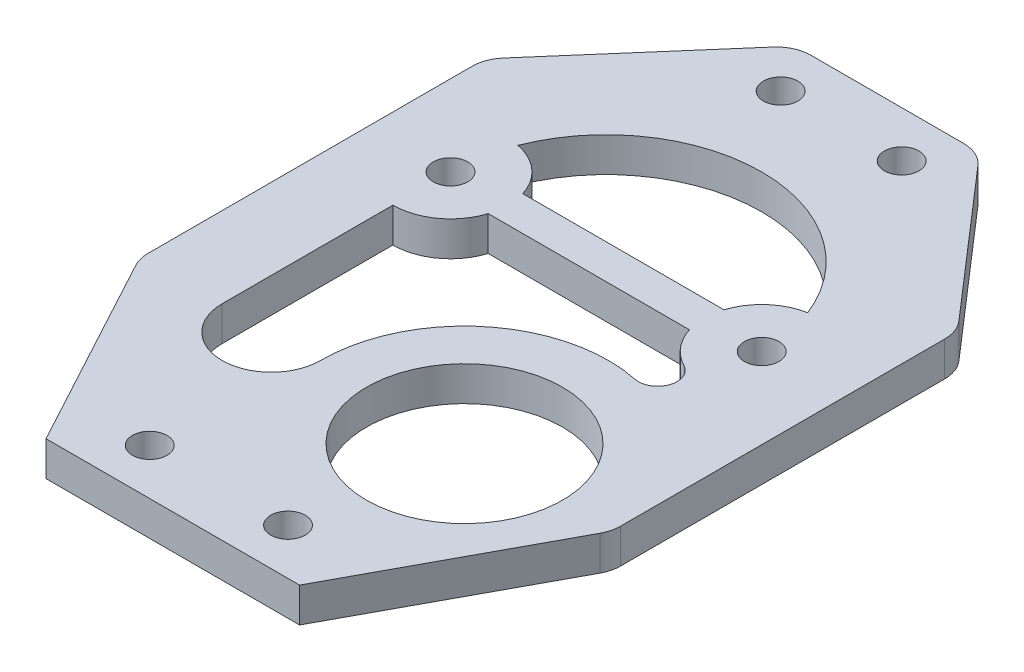
ISO-10303-21;
HEADER;
FILE_DESCRIPTION(('STEP AP214'),'2;1');
FILE_NAME('part.step','',(''),(''),'','','');
FILE_SCHEMA(('AUTOMOTIVE_DESIGN { 1 0 10303 214 1 1 1 1 }'));
ENDSEC;
DATA;
#1=APPLICATION_CONTEXT('core data for automotive mechanical design processes');
#2=APPLICATION_PROTOCOL_DEFINITION('international standard','automotive_design',2000,#1);
#3=PRODUCT_CONTEXT('',#1,'mechanical');
#4=PRODUCT('Part','Part','',(#3));
#5=PRODUCT_RELATED_PRODUCT_CATEGORY('part','',(#4));
#6=PRODUCT_DEFINITION_FORMATION('','',#4);
#7=PRODUCT_DEFINITION_CONTEXT('part definition',#1,'design');
#8=PRODUCT_DEFINITION('design','',#6,#7);
#9=PRODUCT_DEFINITION_SHAPE('','',#8);
#10=(LENGTH_UNIT() NAMED_UNIT(*) SI_UNIT(.MILLI.,.METRE.));
#11=(NAMED_UNIT(*) PLANE_ANGLE_UNIT() SI_UNIT($,.RADIAN.));
#12=(NAMED_UNIT(*) SI_UNIT($,.STERADIAN.) SOLID_ANGLE_UNIT());
#13=UNCERTAINTY_MEASURE_WITH_UNIT(LENGTH_MEASURE(1.E-05),#10,'distance_accuracy_value','');
#14=(GEOMETRIC_REPRESENTATION_CONTEXT(3) GLOBAL_UNCERTAINTY_ASSIGNED_CONTEXT((#13)) GLOBAL_UNIT_ASSIGNED_CONTEXT((#10,
#11,#12)) REPRESENTATION_CONTEXT('',''));
#15=CARTESIAN_POINT('',(0.,0.,0.));
#16=DIRECTION('',(0.,0.,1.));
#17=DIRECTION('',(1.,0.,0.));
#18=AXIS2_PLACEMENT_3D('',#15,#16,#17);
#19=CARTESIAN_POINT('',(0.,1.5,0.));
#20=DIRECTION('',(0.,-1.,0.));
#21=DIRECTION('',(0.,0.,-1.));
#22=AXIS2_PLACEMENT_3D('',#19,#20,#21);
#23=PLANE('',#22);
#24=CARTESIAN_POINT('',(-6.,1.5,-4.));
#25=DIRECTION('',(0.,1.,0.));
#26=DIRECTION('',(0.,0.,1.));
#27=AXIS2_PLACEMENT_3D('',#24,#25,#26);
#28=CIRCLE('',#27,1.5);
#29=CARTESIAN_POINT('',(-6.,1.5,-2.5));
#30=VERTEX_POINT('',#29);
#31=EDGE_CURVE('E240',#30,#30,#28,.T.);
#32=ORIENTED_EDGE('',*,*,#31,.F.);
#33=EDGE_LOOP('',(#32));
#34=FACE_BOUND('',#33,.T.);
#35=CARTESIAN_POINT('',(5.25,1.5,-57.9942617463111));
#36=DIRECTION('',(0.,1.,0.));
#37=DIRECTION('',(0.,0.,1.));
#38=AXIS2_PLACEMENT_3D('',#35,#36,#37);
#39=CIRCLE('',#38,1.5);
#40=CARTESIAN_POINT('',(5.25,1.5,-56.4942617463111));
#41=VERTEX_POINT('',#40);
#42=EDGE_CURVE('E266',#41,#41,#39,.T.);
#43=ORIENTED_EDGE('',*,*,#42,.F.);
#44=EDGE_LOOP('',(#43));
#45=FACE_BOUND('',#44,.T.);
#46=CARTESIAN_POINT('',(-13.5,1.5,-37.599715906798));
#47=DIRECTION('',(0.,1.,0.));
#48=DIRECTION('',(0.,0.,1.));
#49=AXIS2_PLACEMENT_3D('',#46,#47,#48);
#50=CIRCLE('',#49,1.5);
#51=CARTESIAN_POINT('',(-13.5,1.5,-36.099715906798));
#52=VERTEX_POINT('',#51);
#53=EDGE_CURVE('E278',#52,#52,#50,.T.);
#54=ORIENTED_EDGE('',*,*,#53,.F.);
#55=EDGE_LOOP('',(#54));
#56=FACE_BOUND('',#55,.T.);
#57=CARTESIAN_POINT('',(7.53016335359113,1.5,-17.7823011347586));
#58=DIRECTION('',(0.,1.,0.));
#59=DIRECTION('',(0.,0.,1.));
#60=AXIS2_PLACEMENT_3D('',#57,#58,#59);
#61=CIRCLE('',#60,8.5);
#62=CARTESIAN_POINT('',(7.53016335359113,1.5,-9.28230113475864));
#63=VERTEX_POINT('',#62);
#64=EDGE_CURVE('E290',#63,#63,#61,.T.);
#65=ORIENTED_EDGE('',*,*,#64,.F.);
#66=EDGE_LOOP('',(#65));
#67=FACE_BOUND('',#66,.T.);
#68=DIRECTION('',(-1.,0.,0.));
#69=VECTOR('',#68,1.);
#70=CARTESIAN_POINT('',(8.,1.5,-62.));
#71=LINE('',#70,#69);
#72=CARTESIAN_POINT('',(6.63153219568634,1.5,-62.));
#73=VERTEX_POINT('',#72);
#74=CARTESIAN_POINT('',(-6.63153219568634,1.5,-62.));
#75=VERTEX_POINT('',#74);
#76=EDGE_CURVE('E341',#73,#75,#71,.T.);
#77=ORIENTED_EDGE('',*,*,#76,.T.);
#78=CARTESIAN_POINT('',(-6.63153219568634,1.5,-59.));
#79=DIRECTION('',(0.,-1.,0.));
#80=DIRECTION('',(0.,0.,-1.));
#81=AXIS2_PLACEMENT_3D('',#78,#79,#80);
#82=CIRCLE('',#81,3.);
#83=CARTESIAN_POINT('',(-8.89706064011542,1.5,-60.9665657546807));
#84=VERTEX_POINT('',#83);
#85=EDGE_CURVE('E404',#75,#84,#82,.F.);
#86=ORIENTED_EDGE('',*,*,#85,.T.);
#87=DIRECTION('',(-0.655521918226887,0.,0.75517614814303));
#88=VECTOR('',#87,1.);
#89=CARTESIAN_POINT('',(-20.5,1.5,-47.599715906798));
#90=LINE('',#89,#88);
#91=CARTESIAN_POINT('',(-19.7655284444291,1.5,-48.4458438314858));
#92=VERTEX_POINT('',#91);
#93=EDGE_CURVE('E344',#84,#92,#90,.T.);
#94=ORIENTED_EDGE('',*,*,#93,.T.);
#95=CARTESIAN_POINT('',(-17.5,1.5,-46.4792780768051));
#96=DIRECTION('',(0.,-1.,0.));
#97=DIRECTION('',(0.,0.,-1.));
#98=AXIS2_PLACEMENT_3D('',#95,#96,#97);
#99=CIRCLE('',#98,3.);
#100=CARTESIAN_POINT('',(-20.5,1.5,-46.4792780768051));
#101=VERTEX_POINT('',#100);
#102=EDGE_CURVE('E52',#92,#101,#99,.F.);
#103=ORIENTED_EDGE('',*,*,#102,.T.);
#104=DIRECTION('',(0.,0.,1.));
#105=VECTOR('',#104,1.);
#106=CARTESIAN_POINT('',(-20.5,1.5,-17.599715906798));
#107=LINE('',#106,#105);
#108=CARTESIAN_POINT('',(-20.5,1.5,-18.3577003572829));
#109=VERTEX_POINT('',#108);
#110=EDGE_CURVE('E346',#101,#109,#107,.T.);
#111=ORIENTED_EDGE('',*,*,#110,.T.);
#112=CARTESIAN_POINT('',(-17.5,1.5,-18.3577003572829));
#113=DIRECTION('',(0.,-1.,0.));
#114=DIRECTION('',(0.,0.,-1.));
#115=AXIS2_PLACEMENT_3D('',#112,#113,#114);
#116=CIRCLE('',#115,3.);
#117=CARTESIAN_POINT('',(-20.1399573860197,1.5,-16.9327003572829));
#118=VERTEX_POINT('',#117);
#119=EDGE_CURVE('E396',#109,#118,#116,.F.);
#120=ORIENTED_EDGE('',*,*,#119,.T.);
#121=DIRECTION('',(0.475,0.,0.879985795339902));
#122=VECTOR('',#121,1.);
#123=CARTESIAN_POINT('',(-11.,1.5,0.));
#124=LINE('',#123,#122);
#125=CARTESIAN_POINT('',(-11.,1.5,0.));
#126=VERTEX_POINT('',#125);
#127=EDGE_CURVE('E327',#118,#126,#124,.T.);
#128=ORIENTED_EDGE('',*,*,#127,.T.);
#129=DIRECTION('',(1.,0.,0.));
#130=VECTOR('',#129,1.);
#131=CARTESIAN_POINT('',(-11.,1.5,0.));
#132=LINE('',#131,#130);
#133=CARTESIAN_POINT('',(11.,1.5,0.));
#134=VERTEX_POINT('',#133);
#135=EDGE_CURVE('E329',#126,#134,#132,.T.);
#136=ORIENTED_EDGE('',*,*,#135,.T.);
#137=DIRECTION('',(0.475,0.,-0.879985795339902));
#138=VECTOR('',#137,1.);
#139=CARTESIAN_POINT('',(11.,1.5,0.));
#140=LINE('',#139,#138);
#141=CARTESIAN_POINT('',(20.1399573860197,1.5,-16.9327003572829));
#142=VERTEX_POINT('',#141);
#143=EDGE_CURVE('E332',#134,#142,#140,.T.);
#144=ORIENTED_EDGE('',*,*,#143,.T.);
#145=CARTESIAN_POINT('',(17.5,1.5,-18.3577003572829));
#146=DIRECTION('',(0.,-1.,0.));
#147=DIRECTION('',(0.,0.,-1.));
#148=AXIS2_PLACEMENT_3D('',#145,#146,#147);
#149=CIRCLE('',#148,3.);
#150=CARTESIAN_POINT('',(20.5,1.5,-18.3577003572829));
#151=VERTEX_POINT('',#150);
#152=EDGE_CURVE('E398',#142,#151,#149,.F.);
#153=ORIENTED_EDGE('',*,*,#152,.T.);
#154=DIRECTION('',(0.,0.,-1.));
#155=VECTOR('',#154,1.);
#156=CARTESIAN_POINT('',(20.5,1.5,-17.599715906798));
#157=LINE('',#156,#155);
#158=CARTESIAN_POINT('',(20.5,1.5,-46.4792780768051));
#159=VERTEX_POINT('',#158);
#160=EDGE_CURVE('E335',#151,#159,#157,.T.);
#161=ORIENTED_EDGE('',*,*,#160,.T.);
#162=CARTESIAN_POINT('',(17.5,1.5,-46.4792780768051));
#163=DIRECTION('',(0.,-1.,0.));
#164=DIRECTION('',(0.,0.,-1.));
#165=AXIS2_PLACEMENT_3D('',#162,#163,#164);
#166=CIRCLE('',#165,3.);
#167=CARTESIAN_POINT('',(19.7655284444291,1.5,-48.4458438314858));
#168=VERTEX_POINT('',#167);
#169=EDGE_CURVE('E400',#159,#168,#166,.F.);
#170=ORIENTED_EDGE('',*,*,#169,.T.);
#171=DIRECTION('',(-0.655521918226887,0.,-0.75517614814303));
#172=VECTOR('',#171,1.);
#173=CARTESIAN_POINT('',(20.5,1.5,-47.599715906798));
#174=LINE('',#173,#172);
#175=CARTESIAN_POINT('',(8.89706064011542,1.5,-60.9665657546807));
#176=VERTEX_POINT('',#175);
#177=EDGE_CURVE('E338',#168,#176,#174,.T.);
#178=ORIENTED_EDGE('',*,*,#177,.T.);
#179=CARTESIAN_POINT('',(6.63153219568634,1.5,-59.));
#180=DIRECTION('',(0.,-1.,0.));
#181=DIRECTION('',(0.,0.,-1.));
#182=AXIS2_PLACEMENT_3D('',#179,#180,#181);
#183=CIRCLE('',#182,3.);
#184=EDGE_CURVE('E402',#176,#73,#183,.F.);
#185=ORIENTED_EDGE('',*,*,#184,.T.);
#186=EDGE_LOOP('',(#77,#86,#94,#103,#111,#120,#128,#136,#144,#153,#161,#170,#178,#185));
#187=FACE_BOUND('',#186,.T.);
#188=CARTESIAN_POINT('',(-13.5,1.5,-37.599715906798));
#189=DIRECTION('',(0.,-1.,0.));
#190=DIRECTION('',(0.,0.,1.));
#191=AXIS2_PLACEMENT_3D('',#188,#189,#190);
#192=CIRCLE('',#191,5.);
#193=CARTESIAN_POINT('',(-12.5740740740741,1.5,-42.513234114732));
#194=VERTEX_POINT('',#193);
#195=CARTESIAN_POINT('',(-8.73030399291527,1.5,-39.099715906798));
#196=VERTEX_POINT('',#195);
#197=EDGE_CURVE('E296',#194,#196,#192,.T.);
#198=ORIENTED_EDGE('',*,*,#197,.F.);
#199=CARTESIAN_POINT('',(0.,1.5,-37.599715906798));
#200=DIRECTION('',(0.,1.,0.));
#201=DIRECTION('',(0.,0.,1.));
#202=AXIS2_PLACEMENT_3D('',#199,#200,#201);
#203=CIRCLE('',#202,13.5);
#204=CARTESIAN_POINT('',(12.5740740740741,1.5,-42.513234114732));
#205=VERTEX_POINT('',#204);
#206=EDGE_CURVE('E304',#205,#194,#203,.T.);
#207=ORIENTED_EDGE('',*,*,#206,.F.);
#208=CARTESIAN_POINT('',(13.5,1.5,-37.599715906798));
#209=DIRECTION('',(0.,-1.,0.));
#210=DIRECTION('',(0.,0.,-1.));
#211=AXIS2_PLACEMENT_3D('',#208,#209,#210);
#212=CIRCLE('',#211,5.);
#213=CARTESIAN_POINT('',(8.73030399291527,1.5,-39.099715906798));
#214=VERTEX_POINT('',#213);
#215=EDGE_CURVE('E301',#214,#205,#212,.T.);
#216=ORIENTED_EDGE('',*,*,#215,.F.);
#217=DIRECTION('',(1.,0.,0.));
#218=VECTOR('',#217,1.);
#219=CARTESIAN_POINT('',(-8.73030399291527,1.5,-39.099715906798));
#220=LINE('',#219,#218);
#221=EDGE_CURVE('E298',#196,#214,#220,.T.);
#222=ORIENTED_EDGE('',*,*,#221,.F.);
#223=EDGE_LOOP('',(#198,#207,#216,#222));
#224=FACE_BOUND('',#223,.T.);
#225=CARTESIAN_POINT('',(-5.25,1.5,-57.9942617463111));
#226=DIRECTION('',(0.,1.,0.));
#227=DIRECTION('',(0.,0.,1.));
#228=AXIS2_PLACEMENT_3D('',#225,#226,#227);
#229=CIRCLE('',#228,1.5);
#230=CARTESIAN_POINT('',(-5.25,1.5,-56.4942617463111));
#231=VERTEX_POINT('',#230);
#232=EDGE_CURVE('E284',#231,#231,#229,.T.);
#233=ORIENTED_EDGE('',*,*,#232,.F.);
#234=EDGE_LOOP('',(#233));
#235=FACE_BOUND('',#234,.T.);
#236=CARTESIAN_POINT('',(13.5,1.5,-37.599715906798));
#237=DIRECTION('',(0.,1.,0.));
#238=DIRECTION('',(0.,0.,1.));
#239=AXIS2_PLACEMENT_3D('',#236,#237,#238);
#240=CIRCLE('',#239,1.5);
#241=CARTESIAN_POINT('',(13.5,1.5,-36.099715906798));
#242=VERTEX_POINT('',#241);
#243=EDGE_CURVE('E272',#242,#242,#240,.T.);
#244=ORIENTED_EDGE('',*,*,#243,.F.);
#245=EDGE_LOOP('',(#244));
#246=FACE_BOUND('',#245,.T.);
#247=CARTESIAN_POINT('',(10.4087781028521,1.5,-31.6722469483486));
#248=DIRECTION('',(0.,1.,0.));
#249=DIRECTION('',(0.,0.,-1.));
#250=AXIS2_PLACEMENT_3D('',#247,#248,#249);
#251=CIRCLE('',#250,1.68509843388925);
#252=CARTESIAN_POINT('',(10.0668171902538,1.5,-30.0222107468818));
#253=VERTEX_POINT('',#252);
#254=CARTESIAN_POINT('',(11.1879757809718,1.5,-33.1663713442102));
#255=VERTEX_POINT('',#254);
#256=EDGE_CURVE('E200',#253,#255,#251,.T.);
#257=ORIENTED_EDGE('',*,*,#256,.F.);
#258=CARTESIAN_POINT('',(7.53016335359113,1.5,-17.7823011347586));
#259=DIRECTION('',(0.,-1.,0.));
#260=DIRECTION('',(0.,0.,1.));
#261=AXIS2_PLACEMENT_3D('',#258,#259,#260);
#262=CIRCLE('',#261,12.5);
#263=CARTESIAN_POINT('',(-4.96983664640887,1.5,-17.7823011347586));
#264=VERTEX_POINT('',#263);
#265=EDGE_CURVE('E236',#264,#253,#262,.T.);
#266=ORIENTED_EDGE('',*,*,#265,.F.);
#267=CARTESIAN_POINT('',(-9.23491832320443,1.5,-17.7823011347586));
#268=DIRECTION('',(0.,1.,0.));
#269=DIRECTION('',(0.,0.,1.));
#270=AXIS2_PLACEMENT_3D('',#267,#268,#269);
#271=CIRCLE('',#270,4.26508167679556);
#272=CARTESIAN_POINT('',(-13.5,1.5,-17.7823011347586));
#273=VERTEX_POINT('',#272);
#274=EDGE_CURVE('E233',#273,#264,#271,.T.);
#275=ORIENTED_EDGE('',*,*,#274,.F.);
#276=DIRECTION('',(0.,0.,1.));
#277=VECTOR('',#276,1.);
#278=CARTESIAN_POINT('',(-13.5,1.5,-32.599715906798));
#279=LINE('',#278,#277);
#280=CARTESIAN_POINT('',(-13.5,1.5,-32.599715906798));
#281=VERTEX_POINT('',#280);
#282=EDGE_CURVE('E231',#281,#273,#279,.T.);
#283=ORIENTED_EDGE('',*,*,#282,.F.);
#284=CARTESIAN_POINT('',(-13.5,1.5,-37.599715906798));
#285=DIRECTION('',(0.,-1.,0.));
#286=DIRECTION('',(0.,0.,1.));
#287=AXIS2_PLACEMENT_3D('',#284,#285,#286);
#288=CIRCLE('',#287,5.);
#289=CARTESIAN_POINT('',(-8.73030399291528,1.5,-36.099715906798));
#290=VERTEX_POINT('',#289);
#291=EDGE_CURVE('E226',#290,#281,#288,.T.);
#292=ORIENTED_EDGE('',*,*,#291,.F.);
#293=DIRECTION('',(-1.,0.,0.));
#294=VECTOR('',#293,1.);
#295=CARTESIAN_POINT('',(-8.73030399291527,1.5,-36.099715906798));
#296=LINE('',#295,#294);
#297=CARTESIAN_POINT('',(8.73030399291527,1.5,-36.099715906798));
#298=VERTEX_POINT('',#297);
#299=EDGE_CURVE('E224',#298,#290,#296,.T.);
#300=ORIENTED_EDGE('',*,*,#299,.F.);
#301=CARTESIAN_POINT('',(13.5,1.5,-37.599715906798));
#302=DIRECTION('',(0.,-1.,0.));
#303=DIRECTION('',(0.,0.,1.));
#304=AXIS2_PLACEMENT_3D('',#301,#302,#303);
#305=CIRCLE('',#304,5.);
#306=EDGE_CURVE('E210',#255,#298,#305,.T.);
#307=ORIENTED_EDGE('',*,*,#306,.F.);
#308=EDGE_LOOP('',(#257,#266,#275,#283,#292,#300,#307));
#309=FACE_BOUND('',#308,.T.);
#310=CARTESIAN_POINT('',(6.,1.5,-4.));
#311=DIRECTION('',(0.,1.,0.));
#312=DIRECTION('',(0.,0.,1.));
#313=AXIS2_PLACEMENT_3D('',#310,#311,#312);
#314=CIRCLE('',#313,1.5);
#315=CARTESIAN_POINT('',(6.,1.5,-2.5));
#316=VERTEX_POINT('',#315);
#317=EDGE_CURVE('E814',#316,#316,#314,.T.);
#318=ORIENTED_EDGE('',*,*,#317,.F.);
#319=EDGE_LOOP('',(#318));
#320=FACE_BOUND('',#319,.T.);
#321=ADVANCED_FACE('F32',(#34,#45,#56,#67,#187,#224,#235,#246,#309,#320),#23,.F.);
#322=CARTESIAN_POINT('',(0.,-1.5,0.));
#323=DIRECTION('',(0.,-1.,0.));
#324=DIRECTION('',(0.,0.,-1.));
#325=AXIS2_PLACEMENT_3D('',#322,#323,#324);
#326=PLANE('',#325);
#327=CARTESIAN_POINT('',(-6.,-1.5,-4.));
#328=DIRECTION('',(0.,1.,0.));
#329=DIRECTION('',(0.,0.,1.));
#330=AXIS2_PLACEMENT_3D('',#327,#328,#329);
#331=CIRCLE('',#330,1.5);
#332=CARTESIAN_POINT('',(-6.,-1.5,-2.5));
#333=VERTEX_POINT('',#332);
#334=EDGE_CURVE('E817',#333,#333,#331,.T.);
#335=ORIENTED_EDGE('',*,*,#334,.T.);
#336=EDGE_LOOP('',(#335));
#337=FACE_BOUND('',#336,.T.);
#338=CARTESIAN_POINT('',(5.25,-1.5,-57.9942617463111));
#339=DIRECTION('',(0.,1.,0.));
#340=DIRECTION('',(0.,0.,1.));
#341=AXIS2_PLACEMENT_3D('',#338,#339,#340);
#342=CIRCLE('',#341,1.5);
#343=CARTESIAN_POINT('',(5.25,-1.5,-56.4942617463111));
#344=VERTEX_POINT('',#343);
#345=EDGE_CURVE('E218',#344,#344,#342,.T.);
#346=ORIENTED_EDGE('',*,*,#345,.T.);
#347=EDGE_LOOP('',(#346));
#348=FACE_BOUND('',#347,.T.);
#349=CARTESIAN_POINT('',(-13.5,-1.5,-37.599715906798));
#350=DIRECTION('',(0.,1.,0.));
#351=DIRECTION('',(0.,0.,1.));
#352=AXIS2_PLACEMENT_3D('',#349,#350,#351);
#353=CIRCLE('',#352,1.5);
#354=CARTESIAN_POINT('',(-13.5,-1.5,-36.099715906798));
#355=VERTEX_POINT('',#354);
#356=EDGE_CURVE('E275',#355,#355,#353,.T.);
#357=ORIENTED_EDGE('',*,*,#356,.T.);
#358=EDGE_LOOP('',(#357));
#359=FACE_BOUND('',#358,.T.);
#360=CARTESIAN_POINT('',(7.53016335359113,-1.5,-17.7823011347586));
#361=DIRECTION('',(0.,1.,0.));
#362=DIRECTION('',(0.,0.,1.));
#363=AXIS2_PLACEMENT_3D('',#360,#361,#362);
#364=CIRCLE('',#363,8.5);
#365=CARTESIAN_POINT('',(7.53016335359113,-1.5,-9.28230113475864));
#366=VERTEX_POINT('',#365);
#367=EDGE_CURVE('E287',#366,#366,#364,.T.);
#368=ORIENTED_EDGE('',*,*,#367,.T.);
#369=EDGE_LOOP('',(#368));
#370=FACE_BOUND('',#369,.T.);
#371=DIRECTION('',(-0.655521918226887,0.,0.75517614814303));
#372=VECTOR('',#371,1.);
#373=CARTESIAN_POINT('',(-20.5,-1.5,-47.599715906798));
#374=LINE('',#373,#372);
#375=CARTESIAN_POINT('',(-8.89706064011542,-1.5,-60.9665657546807));
#376=VERTEX_POINT('',#375);
#377=CARTESIAN_POINT('',(-19.7655284444291,-1.5,-48.4458438314858));
#378=VERTEX_POINT('',#377);
#379=EDGE_CURVE('E364',#376,#378,#374,.T.);
#380=ORIENTED_EDGE('',*,*,#379,.F.);
#381=CARTESIAN_POINT('',(-6.63153219568634,-1.5,-59.));
#382=DIRECTION('',(0.,-1.,0.));
#383=DIRECTION('',(0.,0.,-1.));
#384=AXIS2_PLACEMENT_3D('',#381,#382,#383);
#385=CIRCLE('',#384,3.);
#386=CARTESIAN_POINT('',(-6.63153219568634,-1.5,-62.));
#387=VERTEX_POINT('',#386);
#388=EDGE_CURVE('E388',#376,#387,#385,.T.);
#389=ORIENTED_EDGE('',*,*,#388,.T.);
#390=DIRECTION('',(-1.,0.,0.));
#391=VECTOR('',#390,1.);
#392=CARTESIAN_POINT('',(8.,-1.5,-62.));
#393=LINE('',#392,#391);
#394=CARTESIAN_POINT('',(6.63153219568634,-1.5,-62.));
#395=VERTEX_POINT('',#394);
#396=EDGE_CURVE('E361',#395,#387,#393,.T.);
#397=ORIENTED_EDGE('',*,*,#396,.F.);
#398=CARTESIAN_POINT('',(6.63153219568634,-1.5,-59.));
#399=DIRECTION('',(0.,-1.,0.));
#400=DIRECTION('',(0.,0.,-1.));
#401=AXIS2_PLACEMENT_3D('',#398,#399,#400);
#402=CIRCLE('',#401,3.);
#403=CARTESIAN_POINT('',(8.89706064011542,-1.5,-60.9665657546807));
#404=VERTEX_POINT('',#403);
#405=EDGE_CURVE('E386',#395,#404,#402,.T.);
#406=ORIENTED_EDGE('',*,*,#405,.T.);
#407=DIRECTION('',(-0.655521918226887,0.,-0.75517614814303));
#408=VECTOR('',#407,1.);
#409=CARTESIAN_POINT('',(20.5,-1.5,-47.599715906798));
#410=LINE('',#409,#408);
#411=CARTESIAN_POINT('',(19.7655284444291,-1.5,-48.4458438314858));
#412=VERTEX_POINT('',#411);
#413=EDGE_CURVE('E358',#412,#404,#410,.T.);
#414=ORIENTED_EDGE('',*,*,#413,.F.);
#415=CARTESIAN_POINT('',(17.5,-1.5,-46.4792780768051));
#416=DIRECTION('',(0.,-1.,0.));
#417=DIRECTION('',(0.,0.,-1.));
#418=AXIS2_PLACEMENT_3D('',#415,#416,#417);
#419=CIRCLE('',#418,3.);
#420=CARTESIAN_POINT('',(20.5,-1.5,-46.4792780768051));
#421=VERTEX_POINT('',#420);
#422=EDGE_CURVE('E384',#412,#421,#419,.T.);
#423=ORIENTED_EDGE('',*,*,#422,.T.);
#424=DIRECTION('',(0.,0.,-1.));
#425=VECTOR('',#424,1.);
#426=CARTESIAN_POINT('',(20.5,-1.5,-17.599715906798));
#427=LINE('',#426,#425);
#428=CARTESIAN_POINT('',(20.5,-1.5,-18.3577003572829));
#429=VERTEX_POINT('',#428);
#430=EDGE_CURVE('E355',#429,#421,#427,.T.);
#431=ORIENTED_EDGE('',*,*,#430,.F.);
#432=CARTESIAN_POINT('',(17.5,-1.5,-18.3577003572829));
#433=DIRECTION('',(0.,-1.,0.));
#434=DIRECTION('',(0.,0.,-1.));
#435=AXIS2_PLACEMENT_3D('',#432,#433,#434);
#436=CIRCLE('',#435,3.);
#437=CARTESIAN_POINT('',(20.1399573860197,-1.5,-16.9327003572829));
#438=VERTEX_POINT('',#437);
#439=EDGE_CURVE('E382',#429,#438,#436,.T.);
#440=ORIENTED_EDGE('',*,*,#439,.T.);
#441=DIRECTION('',(0.475,0.,-0.879985795339902));
#442=VECTOR('',#441,1.);
#443=CARTESIAN_POINT('',(11.,-1.5,0.));
#444=LINE('',#443,#442);
#445=CARTESIAN_POINT('',(11.,-1.5,0.));
#446=VERTEX_POINT('',#445);
#447=EDGE_CURVE('E352',#446,#438,#444,.T.);
#448=ORIENTED_EDGE('',*,*,#447,.F.);
#449=DIRECTION('',(1.,0.,0.));
#450=VECTOR('',#449,1.);
#451=CARTESIAN_POINT('',(-11.,-1.5,0.));
#452=LINE('',#451,#450);
#453=CARTESIAN_POINT('',(-11.,-1.5,0.));
#454=VERTEX_POINT('',#453);
#455=EDGE_CURVE('E350',#454,#446,#452,.T.);
#456=ORIENTED_EDGE('',*,*,#455,.F.);
#457=DIRECTION('',(0.475,0.,0.879985795339902));
#458=VECTOR('',#457,1.);
#459=CARTESIAN_POINT('',(-11.,-1.5,0.));
#460=LINE('',#459,#458);
#461=CARTESIAN_POINT('',(-20.1399573860197,-1.5,-16.9327003572829));
#462=VERTEX_POINT('',#461);
#463=EDGE_CURVE('E326',#462,#454,#460,.T.);
#464=ORIENTED_EDGE('',*,*,#463,.F.);
#465=CARTESIAN_POINT('',(-17.5,-1.5,-18.3577003572829));
#466=DIRECTION('',(0.,-1.,0.));
#467=DIRECTION('',(0.,0.,-1.));
#468=AXIS2_PLACEMENT_3D('',#465,#466,#467);
#469=CIRCLE('',#468,3.);
#470=CARTESIAN_POINT('',(-20.5,-1.5,-18.3577003572829));
#471=VERTEX_POINT('',#470);
#472=EDGE_CURVE('E380',#462,#471,#469,.T.);
#473=ORIENTED_EDGE('',*,*,#472,.T.);
#474=DIRECTION('',(0.,0.,1.));
#475=VECTOR('',#474,1.);
#476=CARTESIAN_POINT('',(-20.5,-1.5,-17.599715906798));
#477=LINE('',#476,#475);
#478=CARTESIAN_POINT('',(-20.5,-1.5,-46.4792780768051));
#479=VERTEX_POINT('',#478);
#480=EDGE_CURVE('E330',#479,#471,#477,.T.);
#481=ORIENTED_EDGE('',*,*,#480,.F.);
#482=CARTESIAN_POINT('',(-17.5,-1.5,-46.4792780768051));
#483=DIRECTION('',(0.,-1.,0.));
#484=DIRECTION('',(0.,0.,-1.));
#485=AXIS2_PLACEMENT_3D('',#482,#483,#484);
#486=CIRCLE('',#485,3.);
#487=EDGE_CURVE('E378',#479,#378,#486,.T.);
#488=ORIENTED_EDGE('',*,*,#487,.T.);
#489=EDGE_LOOP('',(#380,#389,#397,#406,#414,#423,#431,#440,#448,#456,#464,#473,#481,#488));
#490=FACE_BOUND('',#489,.T.);
#491=CARTESIAN_POINT('',(0.,-1.5,-37.599715906798));
#492=DIRECTION('',(0.,1.,0.));
#493=DIRECTION('',(0.,0.,1.));
#494=AXIS2_PLACEMENT_3D('',#491,#492,#493);
#495=CIRCLE('',#494,13.5);
#496=CARTESIAN_POINT('',(12.5740740740741,-1.5,-42.513234114732));
#497=VERTEX_POINT('',#496);
#498=CARTESIAN_POINT('',(-12.5740740740741,-1.5,-42.513234114732));
#499=VERTEX_POINT('',#498);
#500=EDGE_CURVE('E299',#497,#499,#495,.T.);
#501=ORIENTED_EDGE('',*,*,#500,.T.);
#502=CARTESIAN_POINT('',(-13.5,-1.5,-37.599715906798));
#503=DIRECTION('',(0.,-1.,0.));
#504=DIRECTION('',(0.,0.,1.));
#505=AXIS2_PLACEMENT_3D('',#502,#503,#504);
#506=CIRCLE('',#505,5.);
#507=CARTESIAN_POINT('',(-8.73030399291527,-1.5,-39.099715906798));
#508=VERTEX_POINT('',#507);
#509=EDGE_CURVE('E293',#499,#508,#506,.T.);
#510=ORIENTED_EDGE('',*,*,#509,.T.);
#511=DIRECTION('',(1.,0.,0.));
#512=VECTOR('',#511,1.);
#513=CARTESIAN_POINT('',(-8.73030399291527,-1.5,-39.099715906798));
#514=LINE('',#513,#512);
#515=CARTESIAN_POINT('',(8.73030399291527,-1.5,-39.099715906798));
#516=VERTEX_POINT('',#515);
#517=EDGE_CURVE('E309',#508,#516,#514,.T.);
#518=ORIENTED_EDGE('',*,*,#517,.T.);
#519=CARTESIAN_POINT('',(13.5,-1.5,-37.599715906798));
#520=DIRECTION('',(0.,-1.,0.));
#521=DIRECTION('',(0.,0.,-1.));
#522=AXIS2_PLACEMENT_3D('',#519,#520,#521);
#523=CIRCLE('',#522,5.);
#524=EDGE_CURVE('E312',#516,#497,#523,.T.);
#525=ORIENTED_EDGE('',*,*,#524,.T.);
#526=EDGE_LOOP('',(#501,#510,#518,#525));
#527=FACE_BOUND('',#526,.T.);
#528=CARTESIAN_POINT('',(-5.25,-1.5,-57.9942617463111));
#529=DIRECTION('',(0.,1.,0.));
#530=DIRECTION('',(0.,0.,1.));
#531=AXIS2_PLACEMENT_3D('',#528,#529,#530);
#532=CIRCLE('',#531,1.5);
#533=CARTESIAN_POINT('',(-5.25,-1.5,-56.4942617463111));
#534=VERTEX_POINT('',#533);
#535=EDGE_CURVE('E281',#534,#534,#532,.T.);
#536=ORIENTED_EDGE('',*,*,#535,.T.);
#537=EDGE_LOOP('',(#536));
#538=FACE_BOUND('',#537,.T.);
#539=CARTESIAN_POINT('',(13.5,-1.5,-37.599715906798));
#540=DIRECTION('',(0.,1.,0.));
#541=DIRECTION('',(0.,0.,1.));
#542=AXIS2_PLACEMENT_3D('',#539,#540,#541);
#543=CIRCLE('',#542,1.5);
#544=CARTESIAN_POINT('',(13.5,-1.5,-36.099715906798));
#545=VERTEX_POINT('',#544);
#546=EDGE_CURVE('E269',#545,#545,#543,.T.);
#547=ORIENTED_EDGE('',*,*,#546,.T.);
#548=EDGE_LOOP('',(#547));
#549=FACE_BOUND('',#548,.T.);
#550=CARTESIAN_POINT('',(7.53016335359113,-1.5,-17.7823011347586));
#551=DIRECTION('',(0.,-1.,0.));
#552=DIRECTION('',(0.,0.,1.));
#553=AXIS2_PLACEMENT_3D('',#550,#551,#552);
#554=CIRCLE('',#553,12.5);
#555=CARTESIAN_POINT('',(-4.96983664640887,-1.5,-17.7823011347586));
#556=VERTEX_POINT('',#555);
#557=CARTESIAN_POINT('',(10.0668171902538,-1.5,-30.0222107468818));
#558=VERTEX_POINT('',#557);
#559=EDGE_CURVE('E211',#556,#558,#554,.T.);
#560=ORIENTED_EDGE('',*,*,#559,.T.);
#561=CARTESIAN_POINT('',(10.4087781028521,-1.5,-31.6722469483486));
#562=DIRECTION('',(0.,1.,0.));
#563=DIRECTION('',(0.,0.,-1.));
#564=AXIS2_PLACEMENT_3D('',#561,#562,#563);
#565=CIRCLE('',#564,1.68509843388925);
#566=CARTESIAN_POINT('',(11.1879757809718,-1.5,-33.1663713442102));
#567=VERTEX_POINT('',#566);
#568=EDGE_CURVE('E238',#558,#567,#565,.T.);
#569=ORIENTED_EDGE('',*,*,#568,.T.);
#570=CARTESIAN_POINT('',(13.5,-1.5,-37.599715906798));
#571=DIRECTION('',(0.,-1.,0.));
#572=DIRECTION('',(0.,0.,1.));
#573=AXIS2_PLACEMENT_3D('',#570,#571,#572);
#574=CIRCLE('',#573,5.);
#575=CARTESIAN_POINT('',(8.73030399291527,-1.5,-36.099715906798));
#576=VERTEX_POINT('',#575);
#577=EDGE_CURVE('E217',#567,#576,#574,.T.);
#578=ORIENTED_EDGE('',*,*,#577,.T.);
#579=DIRECTION('',(-1.,0.,0.));
#580=VECTOR('',#579,1.);
#581=CARTESIAN_POINT('',(-8.73030399291527,-1.5,-36.099715906798));
#582=LINE('',#581,#580);
#583=CARTESIAN_POINT('',(-8.73030399291528,-1.5,-36.099715906798));
#584=VERTEX_POINT('',#583);
#585=EDGE_CURVE('E242',#576,#584,#582,.T.);
#586=ORIENTED_EDGE('',*,*,#585,.T.);
#587=CARTESIAN_POINT('',(-13.5,-1.5,-37.599715906798));
#588=DIRECTION('',(0.,-1.,0.));
#589=DIRECTION('',(0.,0.,1.));
#590=AXIS2_PLACEMENT_3D('',#587,#588,#589);
#591=CIRCLE('',#590,5.);
#592=CARTESIAN_POINT('',(-13.5,-1.5,-32.599715906798));
#593=VERTEX_POINT('',#592);
#594=EDGE_CURVE('E245',#584,#593,#591,.T.);
#595=ORIENTED_EDGE('',*,*,#594,.T.);
#596=DIRECTION('',(0.,0.,1.));
#597=VECTOR('',#596,1.);
#598=CARTESIAN_POINT('',(-13.5,-1.5,-32.599715906798));
#599=LINE('',#598,#597);
#600=CARTESIAN_POINT('',(-13.5,-1.5,-17.7823011347586));
#601=VERTEX_POINT('',#600);
#602=EDGE_CURVE('E248',#593,#601,#599,.T.);
#603=ORIENTED_EDGE('',*,*,#602,.T.);
#604=CARTESIAN_POINT('',(-9.23491832320443,-1.5,-17.7823011347586));
#605=DIRECTION('',(0.,1.,0.));
#606=DIRECTION('',(0.,0.,1.));
#607=AXIS2_PLACEMENT_3D('',#604,#605,#606);
#608=CIRCLE('',#607,4.26508167679556);
#609=EDGE_CURVE('E251',#601,#556,#608,.T.);
#610=ORIENTED_EDGE('',*,*,#609,.T.);
#611=EDGE_LOOP('',(#560,#569,#578,#586,#595,#603,#610));
#612=FACE_BOUND('',#611,.T.);
#613=CARTESIAN_POINT('',(6.,-1.5,-4.));
#614=DIRECTION('',(0.,1.,0.));
#615=DIRECTION('',(0.,0.,1.));
#616=AXIS2_PLACEMENT_3D('',#613,#614,#615);
#617=CIRCLE('',#616,1.5);
#618=CARTESIAN_POINT('',(6.,-1.5,-2.5));
#619=VERTEX_POINT('',#618);
#620=EDGE_CURVE('E812',#619,#619,#617,.T.);
#621=ORIENTED_EDGE('',*,*,#620,.T.);
#622=EDGE_LOOP('',(#621));
#623=FACE_BOUND('',#622,.T.);
#624=ADVANCED_FACE('F427',(#337,#348,#359,#370,#490,#527,#538,#549,#612,#623),#326,.T.);
#625=CARTESIAN_POINT('',(-11.,1.5,0.));
#626=DIRECTION('',(0.879985795339902,0.,-0.475));
#627=DIRECTION('',(-0.475,0.,-0.879985795339902));
#628=AXIS2_PLACEMENT_3D('',#625,#626,#627);
#629=PLANE('',#628);
#630=ORIENTED_EDGE('',*,*,#127,.F.);
#631=DIRECTION('',(0.,-1.,0.));
#632=VECTOR('',#631,1.);
#633=CARTESIAN_POINT('',(-20.1399573860197,1.5,-16.9327003572829));
#634=LINE('',#633,#632);
#635=EDGE_CURVE('E418',#118,#462,#634,.T.);
#636=ORIENTED_EDGE('',*,*,#635,.T.);
#637=ORIENTED_EDGE('',*,*,#463,.T.);
#638=DIRECTION('',(0.,-1.,0.));
#639=VECTOR('',#638,1.);
#640=CARTESIAN_POINT('',(-11.,1.5,0.));
#641=LINE('',#640,#639);
#642=EDGE_CURVE('E370',#126,#454,#641,.T.);
#643=ORIENTED_EDGE('',*,*,#642,.F.);
#644=EDGE_LOOP('',(#630,#636,#637,#643));
#645=FACE_BOUND('',#644,.T.);
#646=ADVANCED_FACE('F437',(#645),#629,.F.);
#647=CARTESIAN_POINT('',(-11.,1.5,0.));
#648=DIRECTION('',(0.,0.,-1.));
#649=DIRECTION('',(-1.,0.,0.));
#650=AXIS2_PLACEMENT_3D('',#647,#648,#649);
#651=PLANE('',#650);
#652=ORIENTED_EDGE('',*,*,#455,.T.);
#653=DIRECTION('',(0.,-1.,0.));
#654=VECTOR('',#653,1.);
#655=CARTESIAN_POINT('',(11.,1.5,0.));
#656=LINE('',#655,#654);
#657=EDGE_CURVE('E348',#134,#446,#656,.T.);
#658=ORIENTED_EDGE('',*,*,#657,.F.);
#659=ORIENTED_EDGE('',*,*,#135,.F.);
#660=ORIENTED_EDGE('',*,*,#642,.T.);
#661=EDGE_LOOP('',(#652,#658,#659,#660));
#662=FACE_BOUND('',#661,.T.);
#663=ADVANCED_FACE('F443',(#662),#651,.F.);
#664=CARTESIAN_POINT('',(11.,1.5,0.));
#665=DIRECTION('',(-0.879985795339902,0.,-0.475));
#666=DIRECTION('',(-0.475,0.,0.879985795339902));
#667=AXIS2_PLACEMENT_3D('',#664,#665,#666);
#668=PLANE('',#667);
#669=ORIENTED_EDGE('',*,*,#447,.T.);
#670=DIRECTION('',(0.,-1.,0.));
#671=VECTOR('',#670,1.);
#672=CARTESIAN_POINT('',(20.1399573860197,1.5,-16.9327003572829));
#673=LINE('',#672,#671);
#674=EDGE_CURVE('E416',#438,#142,#673,.F.);
#675=ORIENTED_EDGE('',*,*,#674,.T.);
#676=ORIENTED_EDGE('',*,*,#143,.F.);
#677=ORIENTED_EDGE('',*,*,#657,.T.);
#678=EDGE_LOOP('',(#669,#675,#676,#677));
#679=FACE_BOUND('',#678,.T.);
#680=ADVANCED_FACE('F447',(#679),#668,.F.);
#681=CARTESIAN_POINT('',(20.5,1.5,-17.599715906798));
#682=DIRECTION('',(-1.,0.,0.));
#683=DIRECTION('',(0.,0.,1.));
#684=AXIS2_PLACEMENT_3D('',#681,#682,#683);
#685=PLANE('',#684);
#686=ORIENTED_EDGE('',*,*,#430,.T.);
#687=DIRECTION('',(0.,-1.,0.));
#688=VECTOR('',#687,1.);
#689=CARTESIAN_POINT('',(20.5,1.5,-46.4792780768051));
#690=LINE('',#689,#688);
#691=EDGE_CURVE('E414',#421,#159,#690,.F.);
#692=ORIENTED_EDGE('',*,*,#691,.T.);
#693=ORIENTED_EDGE('',*,*,#160,.F.);
#694=DIRECTION('',(0.,-1.,0.));
#695=VECTOR('',#694,1.);
#696=CARTESIAN_POINT('',(20.5,1.5,-18.3577003572829));
#697=LINE('',#696,#695);
#698=EDGE_CURVE('E411',#151,#429,#697,.T.);
#699=ORIENTED_EDGE('',*,*,#698,.T.);
#700=EDGE_LOOP('',(#686,#692,#693,#699));
#701=FACE_BOUND('',#700,.T.);
#702=ADVANCED_FACE('F456',(#701),#685,.F.);
#703=CARTESIAN_POINT('',(20.5,1.5,-47.599715906798));
#704=DIRECTION('',(-0.75517614814303,0.,0.655521918226887));
#705=DIRECTION('',(0.655521918226887,0.,0.75517614814303));
#706=AXIS2_PLACEMENT_3D('',#703,#704,#705);
#707=PLANE('',#706);
#708=ORIENTED_EDGE('',*,*,#413,.T.);
#709=DIRECTION('',(0.,-1.,0.));
#710=VECTOR('',#709,1.);
#711=CARTESIAN_POINT('',(8.89706064011543,1.5,-60.9665657546807));
#712=LINE('',#711,#710);
#713=EDGE_CURVE('E409',#404,#176,#712,.F.);
#714=ORIENTED_EDGE('',*,*,#713,.T.);
#715=ORIENTED_EDGE('',*,*,#177,.F.);
#716=DIRECTION('',(0.,-1.,0.));
#717=VECTOR('',#716,1.);
#718=CARTESIAN_POINT('',(19.7655284444291,1.5,-48.4458438314858));
#719=LINE('',#718,#717);
#720=EDGE_CURVE('E406',#168,#412,#719,.T.);
#721=ORIENTED_EDGE('',*,*,#720,.T.);
#722=EDGE_LOOP('',(#708,#714,#715,#721));
#723=FACE_BOUND('',#722,.T.);
#724=ADVANCED_FACE('F465',(#723),#707,.F.);
#725=CARTESIAN_POINT('',(8.,1.5,-62.));
#726=DIRECTION('',(0.,0.,1.));
#727=DIRECTION('',(1.,0.,0.));
#728=AXIS2_PLACEMENT_3D('',#725,#726,#727);
#729=PLANE('',#728);
#730=ORIENTED_EDGE('',*,*,#396,.T.);
#731=DIRECTION('',(0.,-1.,0.));
#732=VECTOR('',#731,1.);
#733=CARTESIAN_POINT('',(-6.63153219568634,1.5,-62.));
#734=LINE('',#733,#732);
#735=EDGE_CURVE('E393',#387,#75,#734,.F.);
#736=ORIENTED_EDGE('',*,*,#735,.T.);
#737=ORIENTED_EDGE('',*,*,#76,.F.);
#738=DIRECTION('',(0.,-1.,0.));
#739=VECTOR('',#738,1.);
#740=CARTESIAN_POINT('',(6.63153219568634,1.5,-62.));
#741=LINE('',#740,#739);
#742=EDGE_CURVE('E390',#73,#395,#741,.T.);
#743=ORIENTED_EDGE('',*,*,#742,.T.);
#744=EDGE_LOOP('',(#730,#736,#737,#743));
#745=FACE_BOUND('',#744,.T.);
#746=ADVANCED_FACE('F474',(#745),#729,.F.);
#747=CARTESIAN_POINT('',(-20.5,1.5,-47.599715906798));
#748=DIRECTION('',(0.75517614814303,0.,0.655521918226887));
#749=DIRECTION('',(0.655521918226887,0.,-0.75517614814303));
#750=AXIS2_PLACEMENT_3D('',#747,#748,#749);
#751=PLANE('',#750);
#752=ORIENTED_EDGE('',*,*,#93,.F.);
#753=DIRECTION('',(0.,-1.,0.));
#754=VECTOR('',#753,1.);
#755=CARTESIAN_POINT('',(-8.89706064011543,1.5,-60.9665657546807));
#756=LINE('',#755,#754);
#757=EDGE_CURVE('E375',#84,#376,#756,.T.);
#758=ORIENTED_EDGE('',*,*,#757,.T.);
#759=ORIENTED_EDGE('',*,*,#379,.T.);
#760=DIRECTION('',(0.,-1.,0.));
#761=VECTOR('',#760,1.);
#762=CARTESIAN_POINT('',(-19.7655284444291,1.5,-48.4458438314858));
#763=LINE('',#762,#761);
#764=EDGE_CURVE('E373',#378,#92,#763,.F.);
#765=ORIENTED_EDGE('',*,*,#764,.T.);
#766=EDGE_LOOP('',(#752,#758,#759,#765));
#767=FACE_BOUND('',#766,.T.);
#768=ADVANCED_FACE('F482',(#767),#751,.F.);
#769=CARTESIAN_POINT('',(-20.5,1.5,-17.599715906798));
#770=DIRECTION('',(1.,0.,0.));
#771=DIRECTION('',(0.,0.,-1.));
#772=AXIS2_PLACEMENT_3D('',#769,#770,#771);
#773=PLANE('',#772);
#774=ORIENTED_EDGE('',*,*,#480,.T.);
#775=DIRECTION('',(0.,-1.,0.));
#776=VECTOR('',#775,1.);
#777=CARTESIAN_POINT('',(-20.5,1.5,-18.3577003572829));
#778=LINE('',#777,#776);
#779=EDGE_CURVE('E11',#471,#109,#778,.F.);
#780=ORIENTED_EDGE('',*,*,#779,.T.);
#781=ORIENTED_EDGE('',*,*,#110,.F.);
#782=DIRECTION('',(0.,-1.,0.));
#783=VECTOR('',#782,1.);
#784=CARTESIAN_POINT('',(-20.5,1.5,-46.4792780768051));
#785=LINE('',#784,#783);
#786=EDGE_CURVE('E40',#101,#479,#785,.T.);
#787=ORIENTED_EDGE('',*,*,#786,.T.);
#788=EDGE_LOOP('',(#774,#780,#781,#787));
#789=FACE_BOUND('',#788,.T.);
#790=ADVANCED_FACE('F423',(#789),#773,.F.);
#791=CARTESIAN_POINT('',(-13.5,1.5,-37.599715906798));
#792=DIRECTION('',(0.,-1.,0.));
#793=DIRECTION('',(0.,0.,-1.));
#794=AXIS2_PLACEMENT_3D('',#791,#792,#793);
#795=CYLINDRICAL_SURFACE('',#794,5.);
#796=ORIENTED_EDGE('',*,*,#509,.F.);
#797=DIRECTION('',(0.,-1.,0.));
#798=VECTOR('',#797,1.);
#799=CARTESIAN_POINT('',(-12.5740740740741,1.5,-42.513234114732));
#800=LINE('',#799,#798);
#801=EDGE_CURVE('E306',#194,#499,#800,.T.);
#802=ORIENTED_EDGE('',*,*,#801,.F.);
#803=ORIENTED_EDGE('',*,*,#197,.T.);
#804=DIRECTION('',(0.,-1.,0.));
#805=VECTOR('',#804,1.);
#806=CARTESIAN_POINT('',(-8.73030399291527,1.5,-39.099715906798));
#807=LINE('',#806,#805);
#808=EDGE_CURVE('E323',#196,#508,#807,.T.);
#809=ORIENTED_EDGE('',*,*,#808,.T.);
#810=EDGE_LOOP('',(#796,#802,#803,#809));
#811=FACE_BOUND('',#810,.T.);
#812=ADVANCED_FACE('F499',(#811),#795,.T.);
#813=CARTESIAN_POINT('',(-8.73030399291527,1.5,-39.099715906798));
#814=DIRECTION('',(0.,0.,-1.));
#815=DIRECTION('',(-1.,0.,0.));
#816=AXIS2_PLACEMENT_3D('',#813,#814,#815);
#817=PLANE('',#816);
#818=ORIENTED_EDGE('',*,*,#517,.F.);
#819=ORIENTED_EDGE('',*,*,#808,.F.);
#820=ORIENTED_EDGE('',*,*,#221,.T.);
#821=DIRECTION('',(0.,-1.,0.));
#822=VECTOR('',#821,1.);
#823=CARTESIAN_POINT('',(8.73030399291527,1.5,-39.099715906798));
#824=LINE('',#823,#822);
#825=EDGE_CURVE('E321',#214,#516,#824,.T.);
#826=ORIENTED_EDGE('',*,*,#825,.T.);
#827=EDGE_LOOP('',(#818,#819,#820,#826));
#828=FACE_BOUND('',#827,.T.);
#829=ADVANCED_FACE('F696',(#828),#817,.T.);
#830=CARTESIAN_POINT('',(13.5,1.5,-37.599715906798));
#831=DIRECTION('',(0.,-1.,0.));
#832=DIRECTION('',(0.,0.,-1.));
#833=AXIS2_PLACEMENT_3D('',#830,#831,#832);
#834=CYLINDRICAL_SURFACE('',#833,5.);
#835=ORIENTED_EDGE('',*,*,#524,.F.);
#836=ORIENTED_EDGE('',*,*,#825,.F.);
#837=ORIENTED_EDGE('',*,*,#215,.T.);
#838=DIRECTION('',(0.,-1.,0.));
#839=VECTOR('',#838,1.);
#840=CARTESIAN_POINT('',(12.5740740740741,1.5,-42.513234114732));
#841=LINE('',#840,#839);
#842=EDGE_CURVE('E319',#205,#497,#841,.T.);
#843=ORIENTED_EDGE('',*,*,#842,.T.);
#844=EDGE_LOOP('',(#835,#836,#837,#843));
#845=FACE_BOUND('',#844,.T.);
#846=ADVANCED_FACE('F687',(#845),#834,.T.);
#847=CARTESIAN_POINT('',(0.,1.5,-37.599715906798));
#848=DIRECTION('',(0.,-1.,0.));
#849=DIRECTION('',(0.,0.,-1.));
#850=AXIS2_PLACEMENT_3D('',#847,#848,#849);
#851=CYLINDRICAL_SURFACE('',#850,13.5);
#852=ORIENTED_EDGE('',*,*,#500,.F.);
#853=ORIENTED_EDGE('',*,*,#842,.F.);
#854=ORIENTED_EDGE('',*,*,#206,.T.);
#855=ORIENTED_EDGE('',*,*,#801,.T.);
#856=EDGE_LOOP('',(#852,#853,#854,#855));
#857=FACE_BOUND('',#856,.T.);
#858=ADVANCED_FACE('F678',(#857),#851,.F.);
#859=CARTESIAN_POINT('',(7.53016335359113,1.5,-17.7823011347586));
#860=DIRECTION('',(0.,-1.,0.));
#861=DIRECTION('',(0.,0.,-1.));
#862=AXIS2_PLACEMENT_3D('',#859,#860,#861);
#863=CYLINDRICAL_SURFACE('',#862,8.5);
#864=ORIENTED_EDGE('',*,*,#64,.T.);
#865=EDGE_LOOP('',(#864));
#866=FACE_BOUND('',#865,.T.);
#867=ORIENTED_EDGE('',*,*,#367,.F.);
#868=EDGE_LOOP('',(#867));
#869=FACE_BOUND('',#868,.T.);
#870=ADVANCED_FACE('F669',(#866,#869),#863,.F.);
#871=CARTESIAN_POINT('',(-5.25,1.5,-57.9942617463111));
#872=DIRECTION('',(0.,-1.,0.));
#873=DIRECTION('',(0.,0.,-1.));
#874=AXIS2_PLACEMENT_3D('',#871,#872,#873);
#875=CYLINDRICAL_SURFACE('',#874,1.5);
#876=ORIENTED_EDGE('',*,*,#232,.T.);
#877=EDGE_LOOP('',(#876));
#878=FACE_BOUND('',#877,.T.);
#879=ORIENTED_EDGE('',*,*,#535,.F.);
#880=EDGE_LOOP('',(#879));
#881=FACE_BOUND('',#880,.T.);
#882=ADVANCED_FACE('F660',(#878,#881),#875,.F.);
#883=CARTESIAN_POINT('',(-13.5,1.5,-37.599715906798));
#884=DIRECTION('',(0.,-1.,0.));
#885=DIRECTION('',(0.,0.,-1.));
#886=AXIS2_PLACEMENT_3D('',#883,#884,#885);
#887=CYLINDRICAL_SURFACE('',#886,1.5);
#888=ORIENTED_EDGE('',*,*,#53,.T.);
#889=EDGE_LOOP('',(#888));
#890=FACE_BOUND('',#889,.T.);
#891=ORIENTED_EDGE('',*,*,#356,.F.);
#892=EDGE_LOOP('',(#891));
#893=FACE_BOUND('',#892,.T.);
#894=ADVANCED_FACE('F651',(#890,#893),#887,.F.);
#895=CARTESIAN_POINT('',(13.5,1.5,-37.599715906798));
#896=DIRECTION('',(0.,-1.,0.));
#897=DIRECTION('',(0.,0.,-1.));
#898=AXIS2_PLACEMENT_3D('',#895,#896,#897);
#899=CYLINDRICAL_SURFACE('',#898,1.5);
#900=ORIENTED_EDGE('',*,*,#243,.T.);
#901=EDGE_LOOP('',(#900));
#902=FACE_BOUND('',#901,.T.);
#903=ORIENTED_EDGE('',*,*,#546,.F.);
#904=EDGE_LOOP('',(#903));
#905=FACE_BOUND('',#904,.T.);
#906=ADVANCED_FACE('F642',(#902,#905),#899,.F.);
#907=CARTESIAN_POINT('',(5.25,1.5,-57.9942617463111));
#908=DIRECTION('',(0.,-1.,0.));
#909=DIRECTION('',(0.,0.,-1.));
#910=AXIS2_PLACEMENT_3D('',#907,#908,#909);
#911=CYLINDRICAL_SURFACE('',#910,1.5);
#912=ORIENTED_EDGE('',*,*,#42,.T.);
#913=EDGE_LOOP('',(#912));
#914=FACE_BOUND('',#913,.T.);
#915=ORIENTED_EDGE('',*,*,#345,.F.);
#916=EDGE_LOOP('',(#915));
#917=FACE_BOUND('',#916,.T.);
#918=ADVANCED_FACE('F634',(#914,#917),#911,.F.);
#919=CARTESIAN_POINT('',(10.4087781028521,1.5,-31.6722469483486));
#920=DIRECTION('',(0.,-1.,0.));
#921=DIRECTION('',(0.,0.,-1.));
#922=AXIS2_PLACEMENT_3D('',#919,#920,#921);
#923=CYLINDRICAL_SURFACE('',#922,1.68509843388925);
#924=ORIENTED_EDGE('',*,*,#568,.F.);
#925=DIRECTION('',(0.,-1.,0.));
#926=VECTOR('',#925,1.);
#927=CARTESIAN_POINT('',(10.0668171902538,1.5,-30.0222107468818));
#928=LINE('',#927,#926);
#929=EDGE_CURVE('E206',#253,#558,#928,.T.);
#930=ORIENTED_EDGE('',*,*,#929,.F.);
#931=ORIENTED_EDGE('',*,*,#256,.T.);
#932=DIRECTION('',(0.,-1.,0.));
#933=VECTOR('',#932,1.);
#934=CARTESIAN_POINT('',(11.1879757809718,1.5,-33.1663713442102));
#935=LINE('',#934,#933);
#936=EDGE_CURVE('E203',#255,#567,#935,.T.);
#937=ORIENTED_EDGE('',*,*,#936,.T.);
#938=EDGE_LOOP('',(#924,#930,#931,#937));
#939=FACE_BOUND('',#938,.T.);
#940=ADVANCED_FACE('F202',(#939),#923,.F.);
#941=CARTESIAN_POINT('',(13.5,1.5,-37.599715906798));
#942=DIRECTION('',(0.,-1.,0.));
#943=DIRECTION('',(0.,0.,-1.));
#944=AXIS2_PLACEMENT_3D('',#941,#942,#943);
#945=CYLINDRICAL_SURFACE('',#944,5.);
#946=ORIENTED_EDGE('',*,*,#577,.F.);
#947=ORIENTED_EDGE('',*,*,#936,.F.);
#948=ORIENTED_EDGE('',*,*,#306,.T.);
#949=DIRECTION('',(0.,-1.,0.));
#950=VECTOR('',#949,1.);
#951=CARTESIAN_POINT('',(8.73030399291527,1.5,-36.099715906798));
#952=LINE('',#951,#950);
#953=EDGE_CURVE('E219',#298,#576,#952,.T.);
#954=ORIENTED_EDGE('',*,*,#953,.T.);
#955=EDGE_LOOP('',(#946,#947,#948,#954));
#956=FACE_BOUND('',#955,.T.);
#957=ADVANCED_FACE('F214',(#956),#945,.T.);
#958=CARTESIAN_POINT('',(-8.73030399291527,1.5,-36.099715906798));
#959=DIRECTION('',(0.,0.,1.));
#960=DIRECTION('',(1.,0.,0.));
#961=AXIS2_PLACEMENT_3D('',#958,#959,#960);
#962=PLANE('',#961);
#963=ORIENTED_EDGE('',*,*,#585,.F.);
#964=ORIENTED_EDGE('',*,*,#953,.F.);
#965=ORIENTED_EDGE('',*,*,#299,.T.);
#966=DIRECTION('',(0.,-1.,0.));
#967=VECTOR('',#966,1.);
#968=CARTESIAN_POINT('',(-8.73030399291528,1.5,-36.099715906798));
#969=LINE('',#968,#967);
#970=EDGE_CURVE('E263',#290,#584,#969,.T.);
#971=ORIENTED_EDGE('',*,*,#970,.T.);
#972=EDGE_LOOP('',(#963,#964,#965,#971));
#973=FACE_BOUND('',#972,.T.);
#974=ADVANCED_FACE('F610',(#973),#962,.T.);
#975=CARTESIAN_POINT('',(-13.5,1.5,-37.599715906798));
#976=DIRECTION('',(0.,-1.,0.));
#977=DIRECTION('',(0.,0.,-1.));
#978=AXIS2_PLACEMENT_3D('',#975,#976,#977);
#979=CYLINDRICAL_SURFACE('',#978,5.);
#980=ORIENTED_EDGE('',*,*,#594,.F.);
#981=ORIENTED_EDGE('',*,*,#970,.F.);
#982=ORIENTED_EDGE('',*,*,#291,.T.);
#983=DIRECTION('',(0.,-1.,0.));
#984=VECTOR('',#983,1.);
#985=CARTESIAN_POINT('',(-13.5,1.5,-32.599715906798));
#986=LINE('',#985,#984);
#987=EDGE_CURVE('E261',#281,#593,#986,.T.);
#988=ORIENTED_EDGE('',*,*,#987,.T.);
#989=EDGE_LOOP('',(#980,#981,#982,#988));
#990=FACE_BOUND('',#989,.T.);
#991=ADVANCED_FACE('F601',(#990),#979,.T.);
#992=CARTESIAN_POINT('',(-13.5,1.5,-32.599715906798));
#993=DIRECTION('',(1.,0.,0.));
#994=DIRECTION('',(0.,0.,-1.));
#995=AXIS2_PLACEMENT_3D('',#992,#993,#994);
#996=PLANE('',#995);
#997=ORIENTED_EDGE('',*,*,#602,.F.);
#998=ORIENTED_EDGE('',*,*,#987,.F.);
#999=ORIENTED_EDGE('',*,*,#282,.T.);
#1000=DIRECTION('',(0.,-1.,0.));
#1001=VECTOR('',#1000,1.);
#1002=CARTESIAN_POINT('',(-13.5,1.5,-17.7823011347586));
#1003=LINE('',#1002,#1001);
#1004=EDGE_CURVE('E259',#273,#601,#1003,.T.);
#1005=ORIENTED_EDGE('',*,*,#1004,.T.);
#1006=EDGE_LOOP('',(#997,#998,#999,#1005));
#1007=FACE_BOUND('',#1006,.T.);
#1008=ADVANCED_FACE('F592',(#1007),#996,.T.);
#1009=CARTESIAN_POINT('',(-9.23491832320443,1.5,-17.7823011347586));
#1010=DIRECTION('',(0.,-1.,0.));
#1011=DIRECTION('',(0.,0.,-1.));
#1012=AXIS2_PLACEMENT_3D('',#1009,#1010,#1011);
#1013=CYLINDRICAL_SURFACE('',#1012,4.26508167679556);
#1014=ORIENTED_EDGE('',*,*,#609,.F.);
#1015=ORIENTED_EDGE('',*,*,#1004,.F.);
#1016=ORIENTED_EDGE('',*,*,#274,.T.);
#1017=DIRECTION('',(0.,-1.,0.));
#1018=VECTOR('',#1017,1.);
#1019=CARTESIAN_POINT('',(-4.96983664640887,1.5,-17.7823011347586));
#1020=LINE('',#1019,#1018);
#1021=EDGE_CURVE('E257',#264,#556,#1020,.T.);
#1022=ORIENTED_EDGE('',*,*,#1021,.T.);
#1023=EDGE_LOOP('',(#1014,#1015,#1016,#1022));
#1024=FACE_BOUND('',#1023,.T.);
#1025=ADVANCED_FACE('F583',(#1024),#1013,.F.);
#1026=CARTESIAN_POINT('',(7.53016335359113,1.5,-17.7823011347586));
#1027=DIRECTION('',(0.,-1.,0.));
#1028=DIRECTION('',(0.,0.,-1.));
#1029=AXIS2_PLACEMENT_3D('',#1026,#1027,#1028);
#1030=CYLINDRICAL_SURFACE('',#1029,12.5);
#1031=ORIENTED_EDGE('',*,*,#559,.F.);
#1032=ORIENTED_EDGE('',*,*,#1021,.F.);
#1033=ORIENTED_EDGE('',*,*,#265,.T.);
#1034=ORIENTED_EDGE('',*,*,#929,.T.);
#1035=EDGE_LOOP('',(#1031,#1032,#1033,#1034));
#1036=FACE_BOUND('',#1035,.T.);
#1037=ADVANCED_FACE('F574',(#1036),#1030,.T.);
#1038=CARTESIAN_POINT('',(-6.,1.5,-4.));
#1039=DIRECTION('',(0.,-1.,0.));
#1040=DIRECTION('',(0.,0.,-1.));
#1041=AXIS2_PLACEMENT_3D('',#1038,#1039,#1040);
#1042=CYLINDRICAL_SURFACE('',#1041,1.5);
#1043=ORIENTED_EDGE('',*,*,#31,.T.);
#1044=EDGE_LOOP('',(#1043));
#1045=FACE_BOUND('',#1044,.T.);
#1046=ORIENTED_EDGE('',*,*,#334,.F.);
#1047=EDGE_LOOP('',(#1046));
#1048=FACE_BOUND('',#1047,.T.);
#1049=ADVANCED_FACE('F565',(#1045,#1048),#1042,.F.);
#1050=CARTESIAN_POINT('',(6.,1.5,-4.));
#1051=DIRECTION('',(0.,-1.,0.));
#1052=DIRECTION('',(0.,0.,-1.));
#1053=AXIS2_PLACEMENT_3D('',#1050,#1051,#1052);
#1054=CYLINDRICAL_SURFACE('',#1053,1.5);
#1055=ORIENTED_EDGE('',*,*,#317,.T.);
#1056=EDGE_LOOP('',(#1055));
#1057=FACE_BOUND('',#1056,.T.);
#1058=ORIENTED_EDGE('',*,*,#620,.F.);
#1059=EDGE_LOOP('',(#1058));
#1060=FACE_BOUND('',#1059,.T.);
#1061=ADVANCED_FACE('F520',(#1057,#1060),#1054,.F.);
#1062=CARTESIAN_POINT('',(-6.63153219568634,1.5,-59.));
#1063=DIRECTION('',(0.,-1.,0.));
#1064=DIRECTION('',(0.,0.,-1.));
#1065=AXIS2_PLACEMENT_3D('',#1062,#1063,#1064);
#1066=CYLINDRICAL_SURFACE('',#1065,3.);
#1067=ORIENTED_EDGE('',*,*,#85,.F.);
#1068=ORIENTED_EDGE('',*,*,#735,.F.);
#1069=ORIENTED_EDGE('',*,*,#388,.F.);
#1070=ORIENTED_EDGE('',*,*,#757,.F.);
#1071=EDGE_LOOP('',(#1067,#1068,#1069,#1070));
#1072=FACE_BOUND('',#1071,.T.);
#1073=ADVANCED_FACE('F479',(#1072),#1066,.T.);
#1074=CARTESIAN_POINT('',(6.63153219568634,1.5,-59.));
#1075=DIRECTION('',(0.,-1.,0.));
#1076=DIRECTION('',(0.,0.,-1.));
#1077=AXIS2_PLACEMENT_3D('',#1074,#1075,#1076);
#1078=CYLINDRICAL_SURFACE('',#1077,3.);
#1079=ORIENTED_EDGE('',*,*,#184,.F.);
#1080=ORIENTED_EDGE('',*,*,#713,.F.);
#1081=ORIENTED_EDGE('',*,*,#405,.F.);
#1082=ORIENTED_EDGE('',*,*,#742,.F.);
#1083=EDGE_LOOP('',(#1079,#1080,#1081,#1082));
#1084=FACE_BOUND('',#1083,.T.);
#1085=ADVANCED_FACE('F471',(#1084),#1078,.T.);
#1086=CARTESIAN_POINT('',(17.5,1.5,-46.4792780768051));
#1087=DIRECTION('',(0.,-1.,0.));
#1088=DIRECTION('',(0.,0.,-1.));
#1089=AXIS2_PLACEMENT_3D('',#1086,#1087,#1088);
#1090=CYLINDRICAL_SURFACE('',#1089,3.);
#1091=ORIENTED_EDGE('',*,*,#169,.F.);
#1092=ORIENTED_EDGE('',*,*,#691,.F.);
#1093=ORIENTED_EDGE('',*,*,#422,.F.);
#1094=ORIENTED_EDGE('',*,*,#720,.F.);
#1095=EDGE_LOOP('',(#1091,#1092,#1093,#1094));
#1096=FACE_BOUND('',#1095,.T.);
#1097=ADVANCED_FACE('F462',(#1096),#1090,.T.);
#1098=CARTESIAN_POINT('',(17.5,1.5,-18.3577003572829));
#1099=DIRECTION('',(0.,-1.,0.));
#1100=DIRECTION('',(0.,0.,-1.));
#1101=AXIS2_PLACEMENT_3D('',#1098,#1099,#1100);
#1102=CYLINDRICAL_SURFACE('',#1101,3.);
#1103=ORIENTED_EDGE('',*,*,#152,.F.);
#1104=ORIENTED_EDGE('',*,*,#674,.F.);
#1105=ORIENTED_EDGE('',*,*,#439,.F.);
#1106=ORIENTED_EDGE('',*,*,#698,.F.);
#1107=EDGE_LOOP('',(#1103,#1104,#1105,#1106));
#1108=FACE_BOUND('',#1107,.T.);
#1109=ADVANCED_FACE('F453',(#1108),#1102,.T.);
#1110=CARTESIAN_POINT('',(-17.5,1.5,-18.3577003572829));
#1111=DIRECTION('',(0.,-1.,0.));
#1112=DIRECTION('',(0.,0.,-1.));
#1113=AXIS2_PLACEMENT_3D('',#1110,#1111,#1112);
#1114=CYLINDRICAL_SURFACE('',#1113,3.);
#1115=ORIENTED_EDGE('',*,*,#119,.F.);
#1116=ORIENTED_EDGE('',*,*,#779,.F.);
#1117=ORIENTED_EDGE('',*,*,#472,.F.);
#1118=ORIENTED_EDGE('',*,*,#635,.F.);
#1119=EDGE_LOOP('',(#1115,#1116,#1117,#1118));
#1120=FACE_BOUND('',#1119,.T.);
#1121=ADVANCED_FACE('F434',(#1120),#1114,.T.);
#1122=CARTESIAN_POINT('',(-17.5,1.5,-46.4792780768051));
#1123=DIRECTION('',(0.,-1.,0.));
#1124=DIRECTION('',(0.,0.,-1.));
#1125=AXIS2_PLACEMENT_3D('',#1122,#1123,#1124);
#1126=CYLINDRICAL_SURFACE('',#1125,3.);
#1127=ORIENTED_EDGE('',*,*,#102,.F.);
#1128=ORIENTED_EDGE('',*,*,#764,.F.);
#1129=ORIENTED_EDGE('',*,*,#487,.F.);
#1130=ORIENTED_EDGE('',*,*,#786,.F.);
#1131=EDGE_LOOP('',(#1127,#1128,#1129,#1130));
#1132=FACE_BOUND('',#1131,.T.);
#1133=ADVANCED_FACE('F34',(#1132),#1126,.T.);
#1134=CLOSED_SHELL('',(#321,#624,#646,#663,#680,#702,#724,#746,#768,#790,#812,#829,#846,#858,
#870,#882,#894,#906,#918,#940,#957,#974,#991,#1008,#1025,#1037,#1049,#1061,#1073,#1085,#1097,
#1109,#1121,#1133));
#1135=MANIFOLD_SOLID_BREP('B2',#1134);
#1136=ADVANCED_BREP_SHAPE_REPRESENTATION('',(#18,#1135),#14);
#1137=SHAPE_DEFINITION_REPRESENTATION(#9,#1136);
ENDSEC;
END-ISO-10303-21;
